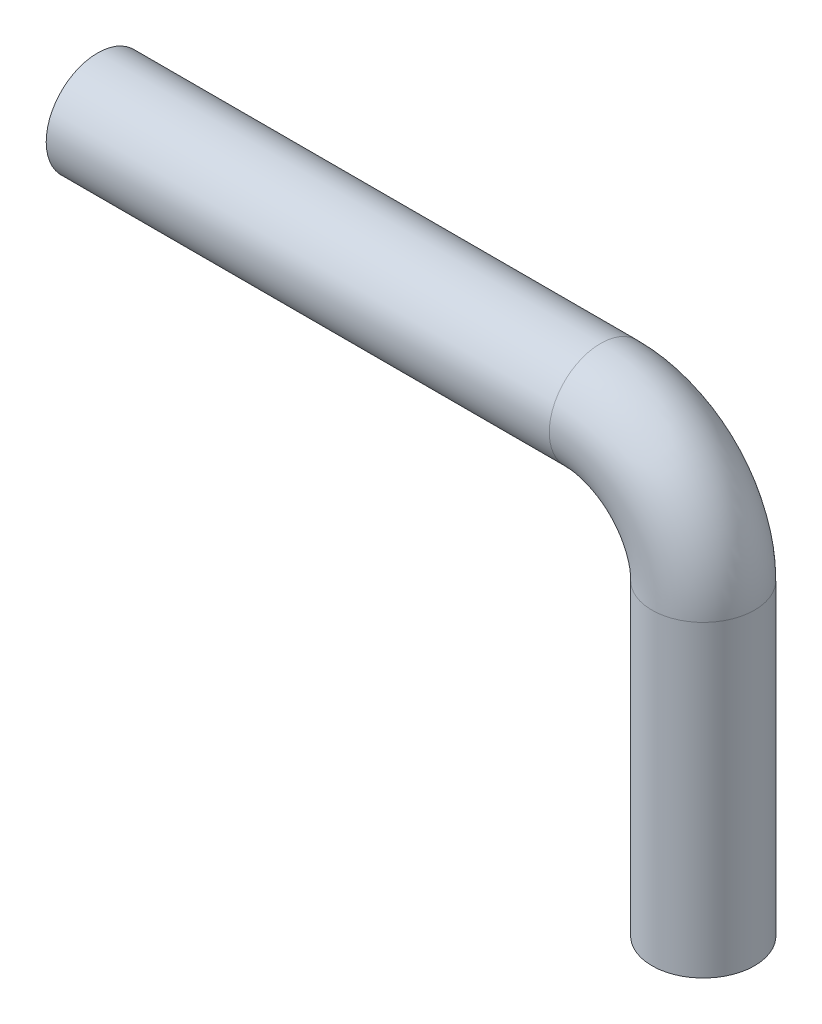
ISO-10303-21;
HEADER;
FILE_DESCRIPTION(('STEP AP214'),'2;1');
FILE_NAME('part.step','',(''),(''),'','','');
FILE_SCHEMA(('AUTOMOTIVE_DESIGN { 1 0 10303 214 1 1 1 1 }'));
ENDSEC;
DATA;
#1=APPLICATION_CONTEXT('core data for automotive mechanical design processes');
#2=APPLICATION_PROTOCOL_DEFINITION('international standard','automotive_design',2000,#1);
#3=PRODUCT_CONTEXT('',#1,'mechanical');
#4=PRODUCT('Part','Part','',(#3));
#5=PRODUCT_RELATED_PRODUCT_CATEGORY('part','',(#4));
#6=PRODUCT_DEFINITION_FORMATION('','',#4);
#7=PRODUCT_DEFINITION_CONTEXT('part definition',#1,'design');
#8=PRODUCT_DEFINITION('design','',#6,#7);
#9=PRODUCT_DEFINITION_SHAPE('','',#8);
#10=(LENGTH_UNIT() NAMED_UNIT(*) SI_UNIT(.MILLI.,.METRE.));
#11=(NAMED_UNIT(*) PLANE_ANGLE_UNIT() SI_UNIT($,.RADIAN.));
#12=(NAMED_UNIT(*) SI_UNIT($,.STERADIAN.) SOLID_ANGLE_UNIT());
#13=UNCERTAINTY_MEASURE_WITH_UNIT(LENGTH_MEASURE(1.E-05),#10,'distance_accuracy_value','');
#14=(GEOMETRIC_REPRESENTATION_CONTEXT(3) GLOBAL_UNCERTAINTY_ASSIGNED_CONTEXT((#13)) GLOBAL_UNIT_ASSIGNED_CONTEXT((#10,
#11,#12)) REPRESENTATION_CONTEXT('',''));
#15=CARTESIAN_POINT('',(0.,0.,0.));
#16=DIRECTION('',(0.,0.,1.));
#17=DIRECTION('',(1.,0.,0.));
#18=AXIS2_PLACEMENT_3D('',#15,#16,#17);
#19=CARTESIAN_POINT('',(0.,0.,0.));
#20=DIRECTION('',(-1.,0.,0.));
#21=DIRECTION('',(0.,0.,1.));
#22=AXIS2_PLACEMENT_3D('',#19,#20,#21);
#23=PLANE('',#22);
#24=CARTESIAN_POINT('',(0.,0.,0.));
#25=DIRECTION('',(-1.,0.,0.));
#26=DIRECTION('',(0.,0.,1.));
#27=AXIS2_PLACEMENT_3D('',#24,#25,#26);
#28=CIRCLE('',#27,5.);
#29=CARTESIAN_POINT('',(0.,0.,5.));
#30=VERTEX_POINT('',#29);
#31=EDGE_CURVE('E59',#30,#30,#28,.T.);
#32=ORIENTED_EDGE('',*,*,#31,.T.);
#33=EDGE_LOOP('',(#32));
#34=FACE_BOUND('',#33,.T.);
#35=ADVANCED_FACE('F47',(#34),#23,.T.);
#36=CARTESIAN_POINT('',(59.,-40.,0.));
#37=DIRECTION('',(0.,1.,0.));
#38=DIRECTION('',(0.,0.,1.));
#39=AXIS2_PLACEMENT_3D('',#36,#37,#38);
#40=PLANE('',#39);
#41=CARTESIAN_POINT('',(59.,-40.,0.));
#42=DIRECTION('',(0.,1.,0.));
#43=DIRECTION('',(0.,0.,1.));
#44=AXIS2_PLACEMENT_3D('',#41,#42,#43);
#45=CIRCLE('',#44,5.);
#46=CARTESIAN_POINT('',(59.,-40.,5.));
#47=VERTEX_POINT('',#46);
#48=EDGE_CURVE('E12',#47,#47,#45,.T.);
#49=ORIENTED_EDGE('',*,*,#48,.F.);
#50=EDGE_LOOP('',(#49));
#51=FACE_BOUND('',#50,.T.);
#52=ADVANCED_FACE('F65',(#51),#40,.F.);
#53=CARTESIAN_POINT('',(0.,0.,0.));
#54=DIRECTION('',(1.,0.,0.));
#55=DIRECTION('',(0.,0.,-1.));
#56=AXIS2_PLACEMENT_3D('',#53,#54,#55);
#57=CYLINDRICAL_SURFACE('',#56,5.);
#58=CARTESIAN_POINT('',(49.,0.,0.));
#59=DIRECTION('',(-1.,0.,0.));
#60=DIRECTION('',(0.,0.,1.));
#61=AXIS2_PLACEMENT_3D('',#58,#59,#60);
#62=CIRCLE('',#61,5.);
#63=CARTESIAN_POINT('',(49.,5.,0.));
#64=VERTEX_POINT('',#63);
#65=EDGE_CURVE('E90',#64,#64,#62,.T.);
#66=ORIENTED_EDGE('',*,*,#65,.T.);
#67=EDGE_LOOP('',(#66));
#68=FACE_BOUND('',#67,.T.);
#69=ORIENTED_EDGE('',*,*,#31,.F.);
#70=EDGE_LOOP('',(#69));
#71=FACE_BOUND('',#70,.T.);
#72=ADVANCED_FACE('F67',(#68,#71),#57,.T.);
#73=CARTESIAN_POINT('',(49.,-10.,0.));
#74=DIRECTION('',(0.,0.,-1.));
#75=DIRECTION('',(-1.,0.,0.));
#76=AXIS2_PLACEMENT_3D('',#73,#74,#75);
#77=TOROIDAL_SURFACE('',#76,10.,5.);
#78=CARTESIAN_POINT('',(59.,-9.99999999999999,0.));
#79=DIRECTION('',(0.,1.,0.));
#80=DIRECTION('',(0.,0.,1.));
#81=AXIS2_PLACEMENT_3D('',#78,#79,#80);
#82=CIRCLE('',#81,5.);
#83=CARTESIAN_POINT('',(64.,-9.99999999999999,0.));
#84=VERTEX_POINT('',#83);
#85=EDGE_CURVE('E54',#84,#84,#82,.T.);
#86=CARTESIAN_POINT('',(49.,-10.,0.));
#87=DIRECTION('',(0.,0.,-1.));
#88=DIRECTION('',(-1.,0.,0.));
#89=AXIS2_PLACEMENT_3D('',#86,#87,#88);
#90=CIRCLE('',#89,15.);
#91=EDGE_CURVE('',#64,#84,#90,.T.);
#92=ORIENTED_EDGE('',*,*,#65,.F.);
#93=ORIENTED_EDGE('',*,*,#85,.T.);
#94=ORIENTED_EDGE('',*,*,#91,.T.);
#95=ORIENTED_EDGE('',*,*,#91,.F.);
#96=EDGE_LOOP('',(#92,#94,#93,#95));
#97=FACE_BOUND('',#96,.T.);
#98=ADVANCED_FACE('F72',(#97),#77,.T.);
#99=CARTESIAN_POINT('',(59.,-10.,0.));
#100=DIRECTION('',(0.,-1.,0.));
#101=DIRECTION('',(1.,0.,0.));
#102=AXIS2_PLACEMENT_3D('',#99,#100,#101);
#103=CYLINDRICAL_SURFACE('',#102,5.);
#104=ORIENTED_EDGE('',*,*,#48,.T.);
#105=EDGE_LOOP('',(#104));
#106=FACE_BOUND('',#105,.T.);
#107=ORIENTED_EDGE('',*,*,#85,.F.);
#108=EDGE_LOOP('',(#107));
#109=FACE_BOUND('',#108,.T.);
#110=ADVANCED_FACE('F62',(#106,#109),#103,.T.);
#111=CLOSED_SHELL('',(#35,#52,#72,#98,#110));
#112=MANIFOLD_SOLID_BREP('B2',#111);
#113=ADVANCED_BREP_SHAPE_REPRESENTATION('',(#18,#112),#14);
#114=SHAPE_DEFINITION_REPRESENTATION(#9,#113);
ENDSEC;
END-ISO-10303-21;
